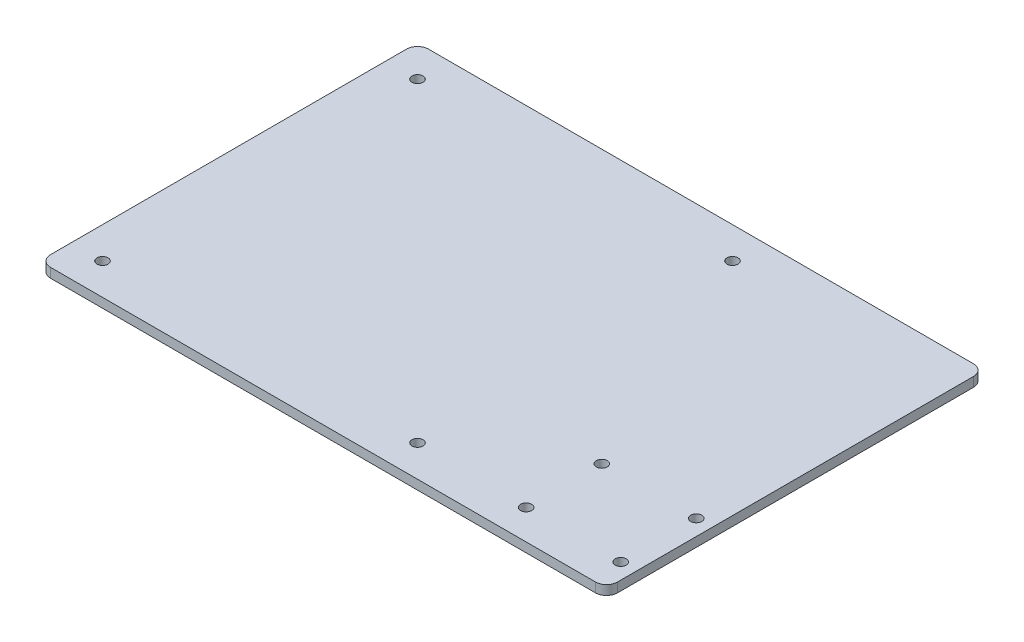
ISO-10303-21;
HEADER;
FILE_DESCRIPTION(('STEP AP214'),'2;1');
FILE_NAME('part.step','',(''),(''),'','','');
FILE_SCHEMA(('AUTOMOTIVE_DESIGN { 1 0 10303 214 1 1 1 1 }'));
ENDSEC;
DATA;
#1=APPLICATION_CONTEXT('core data for automotive mechanical design processes');
#2=APPLICATION_PROTOCOL_DEFINITION('international standard','automotive_design',2000,#1);
#3=PRODUCT_CONTEXT('',#1,'mechanical');
#4=PRODUCT('Part','Part','',(#3));
#5=PRODUCT_RELATED_PRODUCT_CATEGORY('part','',(#4));
#6=PRODUCT_DEFINITION_FORMATION('','',#4);
#7=PRODUCT_DEFINITION_CONTEXT('part definition',#1,'design');
#8=PRODUCT_DEFINITION('design','',#6,#7);
#9=PRODUCT_DEFINITION_SHAPE('','',#8);
#10=(LENGTH_UNIT() NAMED_UNIT(*) SI_UNIT(.MILLI.,.METRE.));
#11=(NAMED_UNIT(*) PLANE_ANGLE_UNIT() SI_UNIT($,.RADIAN.));
#12=(NAMED_UNIT(*) SI_UNIT($,.STERADIAN.) SOLID_ANGLE_UNIT());
#13=UNCERTAINTY_MEASURE_WITH_UNIT(LENGTH_MEASURE(1.E-05),#10,'distance_accuracy_value','');
#14=(GEOMETRIC_REPRESENTATION_CONTEXT(3) GLOBAL_UNCERTAINTY_ASSIGNED_CONTEXT((#13)) GLOBAL_UNIT_ASSIGNED_CONTEXT((#10,
#11,#12)) REPRESENTATION_CONTEXT('',''));
#15=CARTESIAN_POINT('',(0.,0.,0.));
#16=DIRECTION('',(0.,0.,1.));
#17=DIRECTION('',(1.,0.,0.));
#18=AXIS2_PLACEMENT_3D('',#15,#16,#17);
#19=CARTESIAN_POINT('',(0.,3.,0.));
#20=DIRECTION('',(1.,0.,0.));
#21=DIRECTION('',(0.,0.,-1.));
#22=AXIS2_PLACEMENT_3D('',#19,#20,#21);
#23=PLANE('',#22);
#24=DIRECTION('',(0.,0.,1.));
#25=VECTOR('',#24,1.);
#26=CARTESIAN_POINT('',(0.,0.,0.));
#27=LINE('',#26,#25);
#28=CARTESIAN_POINT('',(0.,0.,3.5));
#29=VERTEX_POINT('',#28);
#30=CARTESIAN_POINT('',(0.,0.,116.5));
#31=VERTEX_POINT('',#30);
#32=EDGE_CURVE('E128',#29,#31,#27,.T.);
#33=ORIENTED_EDGE('',*,*,#32,.T.);
#34=DIRECTION('',(0.,-1.,0.));
#35=VECTOR('',#34,1.);
#36=CARTESIAN_POINT('',(0.,3.,116.5));
#37=LINE('',#36,#35);
#38=CARTESIAN_POINT('',(0.,3.,116.5));
#39=VERTEX_POINT('',#38);
#40=EDGE_CURVE('E106',#31,#39,#37,.F.);
#41=ORIENTED_EDGE('',*,*,#40,.T.);
#42=DIRECTION('',(0.,0.,1.));
#43=VECTOR('',#42,1.);
#44=CARTESIAN_POINT('',(0.,3.,0.));
#45=LINE('',#44,#43);
#46=CARTESIAN_POINT('',(0.,3.,3.5));
#47=VERTEX_POINT('',#46);
#48=EDGE_CURVE('E138',#47,#39,#45,.T.);
#49=ORIENTED_EDGE('',*,*,#48,.F.);
#50=DIRECTION('',(0.,-1.,0.));
#51=VECTOR('',#50,1.);
#52=CARTESIAN_POINT('',(0.,3.,3.5));
#53=LINE('',#52,#51);
#54=EDGE_CURVE('E111',#47,#29,#53,.T.);
#55=ORIENTED_EDGE('',*,*,#54,.T.);
#56=EDGE_LOOP('',(#33,#41,#49,#55));
#57=FACE_BOUND('',#56,.T.);
#58=ADVANCED_FACE('F35',(#57),#23,.F.);
#59=CARTESIAN_POINT('',(0.,3.,120.));
#60=DIRECTION('',(0.,0.,-1.));
#61=DIRECTION('',(-1.,0.,0.));
#62=AXIS2_PLACEMENT_3D('',#59,#60,#61);
#63=PLANE('',#62);
#64=DIRECTION('',(1.,0.,0.));
#65=VECTOR('',#64,1.);
#66=CARTESIAN_POINT('',(0.,3.,120.));
#67=LINE('',#66,#65);
#68=CARTESIAN_POINT('',(3.50000000000001,3.,120.));
#69=VERTEX_POINT('',#68);
#70=CARTESIAN_POINT('',(176.5,3.,120.));
#71=VERTEX_POINT('',#70);
#72=EDGE_CURVE('E121',#69,#71,#67,.T.);
#73=ORIENTED_EDGE('',*,*,#72,.F.);
#74=DIRECTION('',(0.,-1.,0.));
#75=VECTOR('',#74,1.);
#76=CARTESIAN_POINT('',(3.50000000000001,3.,120.));
#77=LINE('',#76,#75);
#78=CARTESIAN_POINT('',(3.50000000000001,0.,120.));
#79=VERTEX_POINT('',#78);
#80=EDGE_CURVE('E105',#69,#79,#77,.T.);
#81=ORIENTED_EDGE('',*,*,#80,.T.);
#82=DIRECTION('',(1.,0.,0.));
#83=VECTOR('',#82,1.);
#84=CARTESIAN_POINT('',(0.,0.,120.));
#85=LINE('',#84,#83);
#86=CARTESIAN_POINT('',(176.5,0.,120.));
#87=VERTEX_POINT('',#86);
#88=EDGE_CURVE('E118',#79,#87,#85,.T.);
#89=ORIENTED_EDGE('',*,*,#88,.T.);
#90=DIRECTION('',(0.,-1.,0.));
#91=VECTOR('',#90,1.);
#92=CARTESIAN_POINT('',(176.5,3.,120.));
#93=LINE('',#92,#91);
#94=EDGE_CURVE('E123',#87,#71,#93,.F.);
#95=ORIENTED_EDGE('',*,*,#94,.T.);
#96=EDGE_LOOP('',(#73,#81,#89,#95));
#97=FACE_BOUND('',#96,.T.);
#98=ADVANCED_FACE('F117',(#97),#63,.F.);
#99=CARTESIAN_POINT('',(180.,3.,0.));
#100=DIRECTION('',(-1.,0.,0.));
#101=DIRECTION('',(0.,0.,1.));
#102=AXIS2_PLACEMENT_3D('',#99,#100,#101);
#103=PLANE('',#102);
#104=DIRECTION('',(0.,0.,-1.));
#105=VECTOR('',#104,1.);
#106=CARTESIAN_POINT('',(180.,3.,0.));
#107=LINE('',#106,#105);
#108=CARTESIAN_POINT('',(180.,3.,116.5));
#109=VERTEX_POINT('',#108);
#110=CARTESIAN_POINT('',(180.,3.,3.5));
#111=VERTEX_POINT('',#110);
#112=EDGE_CURVE('E164',#109,#111,#107,.T.);
#113=ORIENTED_EDGE('',*,*,#112,.F.);
#114=DIRECTION('',(0.,-1.,0.));
#115=VECTOR('',#114,1.);
#116=CARTESIAN_POINT('',(180.,3.,116.5));
#117=LINE('',#116,#115);
#118=CARTESIAN_POINT('',(180.,0.,116.5));
#119=VERTEX_POINT('',#118);
#120=EDGE_CURVE('E157',#109,#119,#117,.T.);
#121=ORIENTED_EDGE('',*,*,#120,.T.);
#122=DIRECTION('',(0.,0.,-1.));
#123=VECTOR('',#122,1.);
#124=CARTESIAN_POINT('',(180.,0.,0.));
#125=LINE('',#124,#123);
#126=CARTESIAN_POINT('',(180.,0.,3.5));
#127=VERTEX_POINT('',#126);
#128=EDGE_CURVE('E127',#119,#127,#125,.T.);
#129=ORIENTED_EDGE('',*,*,#128,.T.);
#130=DIRECTION('',(0.,-1.,0.));
#131=VECTOR('',#130,1.);
#132=CARTESIAN_POINT('',(180.,3.,3.5));
#133=LINE('',#132,#131);
#134=EDGE_CURVE('E155',#127,#111,#133,.F.);
#135=ORIENTED_EDGE('',*,*,#134,.T.);
#136=EDGE_LOOP('',(#113,#121,#129,#135));
#137=FACE_BOUND('',#136,.T.);
#138=ADVANCED_FACE('F162',(#137),#103,.F.);
#139=CARTESIAN_POINT('',(0.,3.,0.));
#140=DIRECTION('',(0.,0.,1.));
#141=DIRECTION('',(1.,0.,0.));
#142=AXIS2_PLACEMENT_3D('',#139,#140,#141);
#143=PLANE('',#142);
#144=DIRECTION('',(-1.,0.,0.));
#145=VECTOR('',#144,1.);
#146=CARTESIAN_POINT('',(0.,3.,0.));
#147=LINE('',#146,#145);
#148=CARTESIAN_POINT('',(176.5,3.,0.));
#149=VERTEX_POINT('',#148);
#150=CARTESIAN_POINT('',(3.5,3.,0.));
#151=VERTEX_POINT('',#150);
#152=EDGE_CURVE('E139',#149,#151,#147,.T.);
#153=ORIENTED_EDGE('',*,*,#152,.F.);
#154=DIRECTION('',(0.,-1.,0.));
#155=VECTOR('',#154,1.);
#156=CARTESIAN_POINT('',(176.5,3.,0.));
#157=LINE('',#156,#155);
#158=CARTESIAN_POINT('',(176.5,0.,0.));
#159=VERTEX_POINT('',#158);
#160=EDGE_CURVE('E11',#149,#159,#157,.T.);
#161=ORIENTED_EDGE('',*,*,#160,.T.);
#162=DIRECTION('',(-1.,0.,0.));
#163=VECTOR('',#162,1.);
#164=CARTESIAN_POINT('',(0.,0.,0.));
#165=LINE('',#164,#163);
#166=CARTESIAN_POINT('',(3.5,0.,0.));
#167=VERTEX_POINT('',#166);
#168=EDGE_CURVE('E131',#159,#167,#165,.T.);
#169=ORIENTED_EDGE('',*,*,#168,.T.);
#170=DIRECTION('',(0.,-1.,0.));
#171=VECTOR('',#170,1.);
#172=CARTESIAN_POINT('',(3.5,3.,0.));
#173=LINE('',#172,#171);
#174=EDGE_CURVE('E43',#167,#151,#173,.F.);
#175=ORIENTED_EDGE('',*,*,#174,.T.);
#176=EDGE_LOOP('',(#153,#161,#169,#175));
#177=FACE_BOUND('',#176,.T.);
#178=ADVANCED_FACE('F171',(#177),#143,.F.);
#179=CARTESIAN_POINT('',(0.,3.,0.));
#180=DIRECTION('',(0.,1.,0.));
#181=DIRECTION('',(0.,0.,1.));
#182=AXIS2_PLACEMENT_3D('',#179,#180,#181);
#183=PLANE('',#182);
#184=CARTESIAN_POINT('',(10.,3.,110.));
#185=DIRECTION('',(0.,1.,0.));
#186=DIRECTION('',(0.,0.,-1.));
#187=AXIS2_PLACEMENT_3D('',#184,#185,#186);
#188=CIRCLE('',#187,1.75);
#189=CARTESIAN_POINT('',(10.,3.,108.25));
#190=VERTEX_POINT('',#189);
#191=EDGE_CURVE('E208',#190,#190,#188,.T.);
#192=ORIENTED_EDGE('',*,*,#191,.F.);
#193=EDGE_LOOP('',(#192));
#194=FACE_BOUND('',#193,.T.);
#195=CARTESIAN_POINT('',(9.99999999999999,3.,10.));
#196=DIRECTION('',(0.,1.,0.));
#197=DIRECTION('',(0.,0.,1.));
#198=AXIS2_PLACEMENT_3D('',#195,#196,#197);
#199=CIRCLE('',#198,1.75);
#200=CARTESIAN_POINT('',(9.99999999999999,3.,11.75));
#201=VERTEX_POINT('',#200);
#202=EDGE_CURVE('E214',#201,#201,#199,.T.);
#203=ORIENTED_EDGE('',*,*,#202,.F.);
#204=EDGE_LOOP('',(#203));
#205=FACE_BOUND('',#204,.T.);
#206=CARTESIAN_POINT('',(110.,3.,10.));
#207=DIRECTION('',(0.,1.,0.));
#208=DIRECTION('',(0.,0.,-1.));
#209=AXIS2_PLACEMENT_3D('',#206,#207,#208);
#210=CIRCLE('',#209,1.75000000000001);
#211=CARTESIAN_POINT('',(110.,3.,8.25000000000001));
#212=VERTEX_POINT('',#211);
#213=EDGE_CURVE('E220',#212,#212,#210,.T.);
#214=ORIENTED_EDGE('',*,*,#213,.F.);
#215=EDGE_LOOP('',(#214));
#216=FACE_BOUND('',#215,.T.);
#217=CARTESIAN_POINT('',(110.,3.,110.));
#218=DIRECTION('',(0.,1.,0.));
#219=DIRECTION('',(0.,0.,1.));
#220=AXIS2_PLACEMENT_3D('',#217,#218,#219);
#221=CIRCLE('',#220,1.75000000000001);
#222=CARTESIAN_POINT('',(110.,3.,111.75));
#223=VERTEX_POINT('',#222);
#224=EDGE_CURVE('E202',#223,#223,#221,.T.);
#225=ORIENTED_EDGE('',*,*,#224,.F.);
#226=EDGE_LOOP('',(#225));
#227=FACE_BOUND('',#226,.T.);
#228=CARTESIAN_POINT('',(145.,3.,110.5));
#229=DIRECTION('',(0.,1.,0.));
#230=DIRECTION('',(0.,0.,1.));
#231=AXIS2_PLACEMENT_3D('',#228,#229,#230);
#232=CIRCLE('',#231,1.75000000000001);
#233=CARTESIAN_POINT('',(145.,3.,112.25));
#234=VERTEX_POINT('',#233);
#235=EDGE_CURVE('E191',#234,#234,#232,.T.);
#236=ORIENTED_EDGE('',*,*,#235,.F.);
#237=EDGE_LOOP('',(#236));
#238=FACE_BOUND('',#237,.T.);
#239=CARTESIAN_POINT('',(175.,3.,86.5));
#240=DIRECTION('',(0.,1.,0.));
#241=DIRECTION('',(0.,0.,1.));
#242=AXIS2_PLACEMENT_3D('',#239,#240,#241);
#243=CIRCLE('',#242,1.75000000000001);
#244=CARTESIAN_POINT('',(175.,3.,88.25));
#245=VERTEX_POINT('',#244);
#246=EDGE_CURVE('E184',#245,#245,#243,.T.);
#247=ORIENTED_EDGE('',*,*,#246,.F.);
#248=EDGE_LOOP('',(#247));
#249=FACE_BOUND('',#248,.T.);
#250=CARTESIAN_POINT('',(145.,3.,86.5));
#251=DIRECTION('',(0.,1.,0.));
#252=DIRECTION('',(0.,0.,1.));
#253=AXIS2_PLACEMENT_3D('',#250,#251,#252);
#254=CIRCLE('',#253,1.75000000000001);
#255=CARTESIAN_POINT('',(145.,3.,88.25));
#256=VERTEX_POINT('',#255);
#257=EDGE_CURVE('E196',#256,#256,#254,.T.);
#258=ORIENTED_EDGE('',*,*,#257,.F.);
#259=EDGE_LOOP('',(#258));
#260=FACE_BOUND('',#259,.T.);
#261=CARTESIAN_POINT('',(175.,3.,110.5));
#262=DIRECTION('',(0.,1.,0.));
#263=DIRECTION('',(0.,0.,1.));
#264=AXIS2_PLACEMENT_3D('',#261,#262,#263);
#265=CIRCLE('',#264,1.75000000000001);
#266=CARTESIAN_POINT('',(175.,3.,112.25));
#267=VERTEX_POINT('',#266);
#268=EDGE_CURVE('E178',#267,#267,#265,.T.);
#269=ORIENTED_EDGE('',*,*,#268,.F.);
#270=EDGE_LOOP('',(#269));
#271=FACE_BOUND('',#270,.T.);
#272=ORIENTED_EDGE('',*,*,#48,.T.);
#273=CARTESIAN_POINT('',(3.50000000000001,3.,116.5));
#274=DIRECTION('',(0.,1.,0.));
#275=DIRECTION('',(0.,0.,1.));
#276=AXIS2_PLACEMENT_3D('',#273,#274,#275);
#277=CIRCLE('',#276,3.5);
#278=EDGE_CURVE('E153',#39,#69,#277,.T.);
#279=ORIENTED_EDGE('',*,*,#278,.T.);
#280=ORIENTED_EDGE('',*,*,#72,.T.);
#281=CARTESIAN_POINT('',(176.5,3.,116.5));
#282=DIRECTION('',(0.,1.,0.));
#283=DIRECTION('',(0.,0.,1.));
#284=AXIS2_PLACEMENT_3D('',#281,#282,#283);
#285=CIRCLE('',#284,3.5);
#286=EDGE_CURVE('E151',#71,#109,#285,.T.);
#287=ORIENTED_EDGE('',*,*,#286,.T.);
#288=ORIENTED_EDGE('',*,*,#112,.T.);
#289=CARTESIAN_POINT('',(176.5,3.,3.5));
#290=DIRECTION('',(0.,1.,0.));
#291=DIRECTION('',(0.,0.,1.));
#292=AXIS2_PLACEMENT_3D('',#289,#290,#291);
#293=CIRCLE('',#292,3.5);
#294=EDGE_CURVE('E56',#111,#149,#293,.T.);
#295=ORIENTED_EDGE('',*,*,#294,.T.);
#296=ORIENTED_EDGE('',*,*,#152,.T.);
#297=CARTESIAN_POINT('',(3.5,3.,3.5));
#298=DIRECTION('',(0.,1.,0.));
#299=DIRECTION('',(0.,0.,1.));
#300=AXIS2_PLACEMENT_3D('',#297,#298,#299);
#301=CIRCLE('',#300,3.5);
#302=EDGE_CURVE('E148',#151,#47,#301,.T.);
#303=ORIENTED_EDGE('',*,*,#302,.T.);
#304=EDGE_LOOP('',(#272,#279,#280,#287,#288,#295,#296,#303));
#305=FACE_BOUND('',#304,.T.);
#306=ADVANCED_FACE('F236',(#194,#205,#216,#227,#238,#249,#260,#271,#305),#183,.T.);
#307=CARTESIAN_POINT('',(0.,0.,0.));
#308=DIRECTION('',(0.,1.,0.));
#309=DIRECTION('',(0.,0.,1.));
#310=AXIS2_PLACEMENT_3D('',#307,#308,#309);
#311=PLANE('',#310);
#312=CARTESIAN_POINT('',(10.,0.,110.));
#313=DIRECTION('',(0.,1.,0.));
#314=DIRECTION('',(0.,0.,-1.));
#315=AXIS2_PLACEMENT_3D('',#312,#313,#314);
#316=CIRCLE('',#315,1.75);
#317=CARTESIAN_POINT('',(10.,0.,108.25));
#318=VERTEX_POINT('',#317);
#319=EDGE_CURVE('E211',#318,#318,#316,.T.);
#320=ORIENTED_EDGE('',*,*,#319,.T.);
#321=EDGE_LOOP('',(#320));
#322=FACE_BOUND('',#321,.T.);
#323=CARTESIAN_POINT('',(9.99999999999999,0.,10.));
#324=DIRECTION('',(0.,1.,0.));
#325=DIRECTION('',(0.,0.,1.));
#326=AXIS2_PLACEMENT_3D('',#323,#324,#325);
#327=CIRCLE('',#326,1.75);
#328=CARTESIAN_POINT('',(9.99999999999999,0.,11.75));
#329=VERTEX_POINT('',#328);
#330=EDGE_CURVE('E217',#329,#329,#327,.T.);
#331=ORIENTED_EDGE('',*,*,#330,.T.);
#332=EDGE_LOOP('',(#331));
#333=FACE_BOUND('',#332,.T.);
#334=CARTESIAN_POINT('',(110.,0.,10.));
#335=DIRECTION('',(0.,1.,0.));
#336=DIRECTION('',(0.,0.,-1.));
#337=AXIS2_PLACEMENT_3D('',#334,#335,#336);
#338=CIRCLE('',#337,1.75000000000001);
#339=CARTESIAN_POINT('',(110.,0.,8.25000000000001));
#340=VERTEX_POINT('',#339);
#341=EDGE_CURVE('E205',#340,#340,#338,.T.);
#342=ORIENTED_EDGE('',*,*,#341,.T.);
#343=EDGE_LOOP('',(#342));
#344=FACE_BOUND('',#343,.T.);
#345=CARTESIAN_POINT('',(110.,0.,110.));
#346=DIRECTION('',(0.,1.,0.));
#347=DIRECTION('',(0.,0.,1.));
#348=AXIS2_PLACEMENT_3D('',#345,#346,#347);
#349=CIRCLE('',#348,1.75000000000001);
#350=CARTESIAN_POINT('',(110.,0.,111.75));
#351=VERTEX_POINT('',#350);
#352=EDGE_CURVE('E199',#351,#351,#349,.T.);
#353=ORIENTED_EDGE('',*,*,#352,.T.);
#354=EDGE_LOOP('',(#353));
#355=FACE_BOUND('',#354,.T.);
#356=CARTESIAN_POINT('',(145.,0.,110.5));
#357=DIRECTION('',(0.,1.,0.));
#358=DIRECTION('',(0.,0.,1.));
#359=AXIS2_PLACEMENT_3D('',#356,#357,#358);
#360=CIRCLE('',#359,1.75000000000001);
#361=CARTESIAN_POINT('',(145.,0.,112.25));
#362=VERTEX_POINT('',#361);
#363=EDGE_CURVE('E181',#362,#362,#360,.T.);
#364=ORIENTED_EDGE('',*,*,#363,.T.);
#365=EDGE_LOOP('',(#364));
#366=FACE_BOUND('',#365,.T.);
#367=CARTESIAN_POINT('',(175.,0.,86.5));
#368=DIRECTION('',(0.,1.,0.));
#369=DIRECTION('',(0.,0.,1.));
#370=AXIS2_PLACEMENT_3D('',#367,#368,#369);
#371=CIRCLE('',#370,1.75000000000001);
#372=CARTESIAN_POINT('',(175.,0.,88.25));
#373=VERTEX_POINT('',#372);
#374=EDGE_CURVE('E187',#373,#373,#371,.T.);
#375=ORIENTED_EDGE('',*,*,#374,.T.);
#376=EDGE_LOOP('',(#375));
#377=FACE_BOUND('',#376,.T.);
#378=CARTESIAN_POINT('',(145.,0.,86.5));
#379=DIRECTION('',(0.,1.,0.));
#380=DIRECTION('',(0.,0.,1.));
#381=AXIS2_PLACEMENT_3D('',#378,#379,#380);
#382=CIRCLE('',#381,1.75000000000001);
#383=CARTESIAN_POINT('',(145.,0.,88.25));
#384=VERTEX_POINT('',#383);
#385=EDGE_CURVE('E188',#384,#384,#382,.T.);
#386=ORIENTED_EDGE('',*,*,#385,.T.);
#387=EDGE_LOOP('',(#386));
#388=FACE_BOUND('',#387,.T.);
#389=CARTESIAN_POINT('',(175.,0.,110.5));
#390=DIRECTION('',(0.,1.,0.));
#391=DIRECTION('',(0.,0.,1.));
#392=AXIS2_PLACEMENT_3D('',#389,#390,#391);
#393=CIRCLE('',#392,1.75000000000001);
#394=CARTESIAN_POINT('',(175.,0.,112.25));
#395=VERTEX_POINT('',#394);
#396=EDGE_CURVE('E133',#395,#395,#393,.T.);
#397=ORIENTED_EDGE('',*,*,#396,.T.);
#398=EDGE_LOOP('',(#397));
#399=FACE_BOUND('',#398,.T.);
#400=ORIENTED_EDGE('',*,*,#88,.F.);
#401=CARTESIAN_POINT('',(3.50000000000001,0.,116.5));
#402=DIRECTION('',(0.,1.,0.));
#403=DIRECTION('',(0.,0.,1.));
#404=AXIS2_PLACEMENT_3D('',#401,#402,#403);
#405=CIRCLE('',#404,3.5);
#406=EDGE_CURVE('E101',#79,#31,#405,.F.);
#407=ORIENTED_EDGE('',*,*,#406,.T.);
#408=ORIENTED_EDGE('',*,*,#32,.F.);
#409=CARTESIAN_POINT('',(3.5,0.,3.5));
#410=DIRECTION('',(0.,1.,0.));
#411=DIRECTION('',(0.,0.,1.));
#412=AXIS2_PLACEMENT_3D('',#409,#410,#411);
#413=CIRCLE('',#412,3.5);
#414=EDGE_CURVE('E122',#29,#167,#413,.F.);
#415=ORIENTED_EDGE('',*,*,#414,.T.);
#416=ORIENTED_EDGE('',*,*,#168,.F.);
#417=CARTESIAN_POINT('',(176.5,0.,3.5));
#418=DIRECTION('',(0.,1.,0.));
#419=DIRECTION('',(0.,0.,1.));
#420=AXIS2_PLACEMENT_3D('',#417,#418,#419);
#421=CIRCLE('',#420,3.5);
#422=EDGE_CURVE('E142',#159,#127,#421,.F.);
#423=ORIENTED_EDGE('',*,*,#422,.T.);
#424=ORIENTED_EDGE('',*,*,#128,.F.);
#425=CARTESIAN_POINT('',(176.5,0.,116.5));
#426=DIRECTION('',(0.,1.,0.));
#427=DIRECTION('',(0.,0.,1.));
#428=AXIS2_PLACEMENT_3D('',#425,#426,#427);
#429=CIRCLE('',#428,3.5);
#430=EDGE_CURVE('E112',#119,#87,#429,.F.);
#431=ORIENTED_EDGE('',*,*,#430,.T.);
#432=EDGE_LOOP('',(#400,#407,#408,#415,#416,#423,#424,#431));
#433=FACE_BOUND('',#432,.T.);
#434=ADVANCED_FACE('F125',(#322,#333,#344,#355,#366,#377,#388,#399,#433),#311,.F.);
#435=CARTESIAN_POINT('',(3.50000000000001,3.,116.5));
#436=DIRECTION('',(0.,-1.,0.));
#437=DIRECTION('',(0.,0.,-1.));
#438=AXIS2_PLACEMENT_3D('',#435,#436,#437);
#439=CYLINDRICAL_SURFACE('',#438,3.5);
#440=ORIENTED_EDGE('',*,*,#278,.F.);
#441=ORIENTED_EDGE('',*,*,#40,.F.);
#442=ORIENTED_EDGE('',*,*,#406,.F.);
#443=ORIENTED_EDGE('',*,*,#80,.F.);
#444=EDGE_LOOP('',(#440,#441,#442,#443));
#445=FACE_BOUND('',#444,.T.);
#446=ADVANCED_FACE('F104',(#445),#439,.T.);
#447=CARTESIAN_POINT('',(176.5,3.,116.5));
#448=DIRECTION('',(0.,-1.,0.));
#449=DIRECTION('',(0.,0.,-1.));
#450=AXIS2_PLACEMENT_3D('',#447,#448,#449);
#451=CYLINDRICAL_SURFACE('',#450,3.5);
#452=ORIENTED_EDGE('',*,*,#286,.F.);
#453=ORIENTED_EDGE('',*,*,#94,.F.);
#454=ORIENTED_EDGE('',*,*,#430,.F.);
#455=ORIENTED_EDGE('',*,*,#120,.F.);
#456=EDGE_LOOP('',(#452,#453,#454,#455));
#457=FACE_BOUND('',#456,.T.);
#458=ADVANCED_FACE('F263',(#457),#451,.T.);
#459=CARTESIAN_POINT('',(176.5,3.,3.5));
#460=DIRECTION('',(0.,-1.,0.));
#461=DIRECTION('',(0.,0.,-1.));
#462=AXIS2_PLACEMENT_3D('',#459,#460,#461);
#463=CYLINDRICAL_SURFACE('',#462,3.5);
#464=ORIENTED_EDGE('',*,*,#294,.F.);
#465=ORIENTED_EDGE('',*,*,#134,.F.);
#466=ORIENTED_EDGE('',*,*,#422,.F.);
#467=ORIENTED_EDGE('',*,*,#160,.F.);
#468=EDGE_LOOP('',(#464,#465,#466,#467));
#469=FACE_BOUND('',#468,.T.);
#470=ADVANCED_FACE('F170',(#469),#463,.T.);
#471=CARTESIAN_POINT('',(3.5,3.,3.5));
#472=DIRECTION('',(0.,-1.,0.));
#473=DIRECTION('',(0.,0.,-1.));
#474=AXIS2_PLACEMENT_3D('',#471,#472,#473);
#475=CYLINDRICAL_SURFACE('',#474,3.5);
#476=ORIENTED_EDGE('',*,*,#302,.F.);
#477=ORIENTED_EDGE('',*,*,#174,.F.);
#478=ORIENTED_EDGE('',*,*,#414,.F.);
#479=ORIENTED_EDGE('',*,*,#54,.F.);
#480=EDGE_LOOP('',(#476,#477,#478,#479));
#481=FACE_BOUND('',#480,.T.);
#482=ADVANCED_FACE('F37',(#481),#475,.T.);
#483=CARTESIAN_POINT('',(175.,0.,110.5));
#484=DIRECTION('',(0.,1.,0.));
#485=DIRECTION('',(0.,0.,1.));
#486=AXIS2_PLACEMENT_3D('',#483,#484,#485);
#487=CYLINDRICAL_SURFACE('',#486,1.75000000000001);
#488=ORIENTED_EDGE('',*,*,#396,.F.);
#489=EDGE_LOOP('',(#488));
#490=FACE_BOUND('',#489,.T.);
#491=ORIENTED_EDGE('',*,*,#268,.T.);
#492=EDGE_LOOP('',(#491));
#493=FACE_BOUND('',#492,.T.);
#494=ADVANCED_FACE('F255',(#490,#493),#487,.F.);
#495=CARTESIAN_POINT('',(145.,0.,86.5));
#496=DIRECTION('',(0.,1.,0.));
#497=DIRECTION('',(0.,0.,1.));
#498=AXIS2_PLACEMENT_3D('',#495,#496,#497);
#499=CYLINDRICAL_SURFACE('',#498,1.75000000000001);
#500=ORIENTED_EDGE('',*,*,#385,.F.);
#501=EDGE_LOOP('',(#500));
#502=FACE_BOUND('',#501,.T.);
#503=ORIENTED_EDGE('',*,*,#257,.T.);
#504=EDGE_LOOP('',(#503));
#505=FACE_BOUND('',#504,.T.);
#506=ADVANCED_FACE('F260',(#502,#505),#499,.F.);
#507=CARTESIAN_POINT('',(175.,0.,86.5));
#508=DIRECTION('',(0.,1.,0.));
#509=DIRECTION('',(0.,0.,1.));
#510=AXIS2_PLACEMENT_3D('',#507,#508,#509);
#511=CYLINDRICAL_SURFACE('',#510,1.75000000000001);
#512=ORIENTED_EDGE('',*,*,#374,.F.);
#513=EDGE_LOOP('',(#512));
#514=FACE_BOUND('',#513,.T.);
#515=ORIENTED_EDGE('',*,*,#246,.T.);
#516=EDGE_LOOP('',(#515));
#517=FACE_BOUND('',#516,.T.);
#518=ADVANCED_FACE('F303',(#514,#517),#511,.F.);
#519=CARTESIAN_POINT('',(145.,0.,110.5));
#520=DIRECTION('',(0.,1.,0.));
#521=DIRECTION('',(0.,0.,1.));
#522=AXIS2_PLACEMENT_3D('',#519,#520,#521);
#523=CYLINDRICAL_SURFACE('',#522,1.75000000000001);
#524=ORIENTED_EDGE('',*,*,#363,.F.);
#525=EDGE_LOOP('',(#524));
#526=FACE_BOUND('',#525,.T.);
#527=ORIENTED_EDGE('',*,*,#235,.T.);
#528=EDGE_LOOP('',(#527));
#529=FACE_BOUND('',#528,.T.);
#530=ADVANCED_FACE('F313',(#526,#529),#523,.F.);
#531=CARTESIAN_POINT('',(110.,0.,110.));
#532=DIRECTION('',(0.,1.,0.));
#533=DIRECTION('',(0.,0.,1.));
#534=AXIS2_PLACEMENT_3D('',#531,#532,#533);
#535=CYLINDRICAL_SURFACE('',#534,1.75000000000001);
#536=ORIENTED_EDGE('',*,*,#352,.F.);
#537=EDGE_LOOP('',(#536));
#538=FACE_BOUND('',#537,.T.);
#539=ORIENTED_EDGE('',*,*,#224,.T.);
#540=EDGE_LOOP('',(#539));
#541=FACE_BOUND('',#540,.T.);
#542=ADVANCED_FACE('F232',(#538,#541),#535,.F.);
#543=CARTESIAN_POINT('',(110.,0.,10.));
#544=DIRECTION('',(0.,1.,0.));
#545=DIRECTION('',(0.,0.,1.));
#546=AXIS2_PLACEMENT_3D('',#543,#544,#545);
#547=CYLINDRICAL_SURFACE('',#546,1.75000000000001);
#548=ORIENTED_EDGE('',*,*,#341,.F.);
#549=EDGE_LOOP('',(#548));
#550=FACE_BOUND('',#549,.T.);
#551=ORIENTED_EDGE('',*,*,#213,.T.);
#552=EDGE_LOOP('',(#551));
#553=FACE_BOUND('',#552,.T.);
#554=ADVANCED_FACE('F228',(#550,#553),#547,.F.);
#555=CARTESIAN_POINT('',(9.99999999999999,0.,10.));
#556=DIRECTION('',(0.,1.,0.));
#557=DIRECTION('',(0.,0.,1.));
#558=AXIS2_PLACEMENT_3D('',#555,#556,#557);
#559=CYLINDRICAL_SURFACE('',#558,1.75);
#560=ORIENTED_EDGE('',*,*,#330,.F.);
#561=EDGE_LOOP('',(#560));
#562=FACE_BOUND('',#561,.T.);
#563=ORIENTED_EDGE('',*,*,#202,.T.);
#564=EDGE_LOOP('',(#563));
#565=FACE_BOUND('',#564,.T.);
#566=ADVANCED_FACE('F231',(#562,#565),#559,.F.);
#567=CARTESIAN_POINT('',(10.,0.,110.));
#568=DIRECTION('',(0.,1.,0.));
#569=DIRECTION('',(0.,0.,1.));
#570=AXIS2_PLACEMENT_3D('',#567,#568,#569);
#571=CYLINDRICAL_SURFACE('',#570,1.75);
#572=ORIENTED_EDGE('',*,*,#319,.F.);
#573=EDGE_LOOP('',(#572));
#574=FACE_BOUND('',#573,.T.);
#575=ORIENTED_EDGE('',*,*,#191,.T.);
#576=EDGE_LOOP('',(#575));
#577=FACE_BOUND('',#576,.T.);
#578=ADVANCED_FACE('F364',(#574,#577),#571,.F.);
#579=CLOSED_SHELL('',(#58,#98,#138,#178,#306,#434,#446,#458,#470,#482,#494,#506,#518,#530,#542,
#554,#566,#578));
#580=MANIFOLD_SOLID_BREP('B2',#579);
#581=ADVANCED_BREP_SHAPE_REPRESENTATION('',(#18,#580),#14);
#582=SHAPE_DEFINITION_REPRESENTATION(#9,#581);
ENDSEC;
END-ISO-10303-21;
